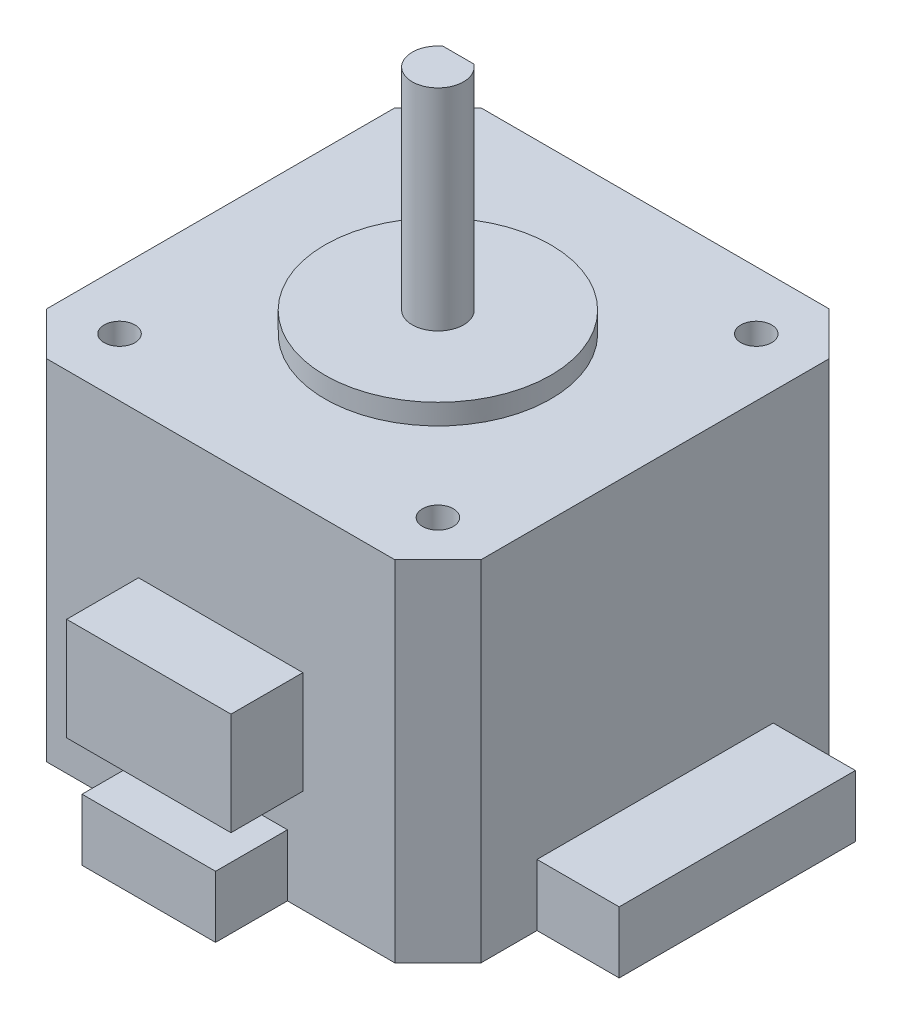
ISO-10303-21;
HEADER;
FILE_DESCRIPTION(('STEP AP214'),'2;1');
FILE_NAME('part.step','',(''),(''),'','','');
FILE_SCHEMA(('AUTOMOTIVE_DESIGN { 1 0 10303 214 1 1 1 1 }'));
ENDSEC;
DATA;
#1=APPLICATION_CONTEXT('core data for automotive mechanical design processes');
#2=APPLICATION_PROTOCOL_DEFINITION('international standard','automotive_design',2000,#1);
#3=PRODUCT_CONTEXT('',#1,'mechanical');
#4=PRODUCT('Part','Part','',(#3));
#5=PRODUCT_RELATED_PRODUCT_CATEGORY('part','',(#4));
#6=PRODUCT_DEFINITION_FORMATION('','',#4);
#7=PRODUCT_DEFINITION_CONTEXT('part definition',#1,'design');
#8=PRODUCT_DEFINITION('design','',#6,#7);
#9=PRODUCT_DEFINITION_SHAPE('','',#8);
#10=(LENGTH_UNIT() NAMED_UNIT(*) SI_UNIT(.MILLI.,.METRE.));
#11=(NAMED_UNIT(*) PLANE_ANGLE_UNIT() SI_UNIT($,.RADIAN.));
#12=(NAMED_UNIT(*) SI_UNIT($,.STERADIAN.) SOLID_ANGLE_UNIT());
#13=UNCERTAINTY_MEASURE_WITH_UNIT(LENGTH_MEASURE(1.E-05),#10,'distance_accuracy_value','');
#14=(GEOMETRIC_REPRESENTATION_CONTEXT(3) GLOBAL_UNCERTAINTY_ASSIGNED_CONTEXT((#13)) GLOBAL_UNIT_ASSIGNED_CONTEXT((#10,
#11,#12)) REPRESENTATION_CONTEXT('',''));
#15=CARTESIAN_POINT('',(0.,0.,0.));
#16=DIRECTION('',(0.,0.,1.));
#17=DIRECTION('',(1.,0.,0.));
#18=AXIS2_PLACEMENT_3D('',#15,#16,#17);
#19=CARTESIAN_POINT('',(42.3,34.,0.));
#20=DIRECTION('',(-1.,0.,0.));
#21=DIRECTION('',(0.,0.,1.));
#22=AXIS2_PLACEMENT_3D('',#19,#20,#21);
#23=PLANE('',#22);
#24=DIRECTION('',(0.,-1.,0.));
#25=VECTOR('',#24,1.);
#26=CARTESIAN_POINT('',(42.3,0.,-9.64999999999999));
#27=LINE('',#26,#25);
#28=CARTESIAN_POINT('',(42.3,6.,-9.64999999999999));
#29=VERTEX_POINT('',#28);
#30=CARTESIAN_POINT('',(42.3,0.,-9.64999999999999));
#31=VERTEX_POINT('',#30);
#32=EDGE_CURVE('E58',#29,#31,#27,.T.);
#33=ORIENTED_EDGE('',*,*,#32,.F.);
#34=DIRECTION('',(0.,0.,1.));
#35=VECTOR('',#34,1.);
#36=CARTESIAN_POINT('',(42.3,6.,-9.64999999999999));
#37=LINE('',#36,#35);
#38=CARTESIAN_POINT('',(42.3,6.,-32.65));
#39=VERTEX_POINT('',#38);
#40=EDGE_CURVE('E212',#39,#29,#37,.T.);
#41=ORIENTED_EDGE('',*,*,#40,.F.);
#42=DIRECTION('',(0.,1.,0.));
#43=VECTOR('',#42,1.);
#44=CARTESIAN_POINT('',(42.3,0.,-32.65));
#45=LINE('',#44,#43);
#46=CARTESIAN_POINT('',(42.3,0.,-32.65));
#47=VERTEX_POINT('',#46);
#48=EDGE_CURVE('E64',#47,#39,#45,.T.);
#49=ORIENTED_EDGE('',*,*,#48,.F.);
#50=DIRECTION('',(0.,0.,-1.));
#51=VECTOR('',#50,1.);
#52=CARTESIAN_POINT('',(42.3,0.,0.));
#53=LINE('',#52,#51);
#54=CARTESIAN_POINT('',(42.3,0.,-38.1));
#55=VERTEX_POINT('',#54);
#56=EDGE_CURVE('E345',#47,#55,#53,.T.);
#57=ORIENTED_EDGE('',*,*,#56,.T.);
#58=DIRECTION('',(0.,1.,0.));
#59=VECTOR('',#58,1.);
#60=CARTESIAN_POINT('',(42.3,34.,-38.1));
#61=LINE('',#60,#59);
#62=CARTESIAN_POINT('',(42.3,34.,-38.1));
#63=VERTEX_POINT('',#62);
#64=EDGE_CURVE('E380',#55,#63,#61,.T.);
#65=ORIENTED_EDGE('',*,*,#64,.T.);
#66=DIRECTION('',(0.,0.,-1.));
#67=VECTOR('',#66,1.);
#68=CARTESIAN_POINT('',(42.3,34.,0.));
#69=LINE('',#68,#67);
#70=CARTESIAN_POINT('',(42.3,34.,-4.2));
#71=VERTEX_POINT('',#70);
#72=EDGE_CURVE('E333',#71,#63,#69,.T.);
#73=ORIENTED_EDGE('',*,*,#72,.F.);
#74=DIRECTION('',(0.,-1.,0.));
#75=VECTOR('',#74,1.);
#76=CARTESIAN_POINT('',(42.3,34.,-4.2));
#77=LINE('',#76,#75);
#78=CARTESIAN_POINT('',(42.3,0.,-4.2));
#79=VERTEX_POINT('',#78);
#80=EDGE_CURVE('E377',#71,#79,#77,.T.);
#81=ORIENTED_EDGE('',*,*,#80,.T.);
#82=EDGE_CURVE('E346',#79,#31,#53,.T.);
#83=ORIENTED_EDGE('',*,*,#82,.T.);
#84=EDGE_LOOP('',(#33,#41,#49,#57,#65,#73,#81,#83));
#85=FACE_BOUND('',#84,.T.);
#86=ADVANCED_FACE('F41',(#85),#23,.F.);
#87=CARTESIAN_POINT('',(0.,34.,0.));
#88=DIRECTION('',(0.,0.,-1.));
#89=DIRECTION('',(-1.,0.,0.));
#90=AXIS2_PLACEMENT_3D('',#87,#88,#89);
#91=PLANE('',#90);
#92=DIRECTION('',(0.,-1.,0.));
#93=VECTOR('',#92,1.);
#94=CARTESIAN_POINT('',(13.15,20.,0.));
#95=LINE('',#94,#93);
#96=CARTESIAN_POINT('',(13.15,20.,0.));
#97=VERTEX_POINT('',#96);
#98=CARTESIAN_POINT('',(13.15,10.,0.));
#99=VERTEX_POINT('',#98);
#100=EDGE_CURVE('E250',#97,#99,#95,.T.);
#101=ORIENTED_EDGE('',*,*,#100,.F.);
#102=DIRECTION('',(-1.,0.,0.));
#103=VECTOR('',#102,1.);
#104=CARTESIAN_POINT('',(13.15,20.,0.));
#105=LINE('',#104,#103);
#106=CARTESIAN_POINT('',(29.15,20.,0.));
#107=VERTEX_POINT('',#106);
#108=EDGE_CURVE('E255',#107,#97,#105,.T.);
#109=ORIENTED_EDGE('',*,*,#108,.F.);
#110=DIRECTION('',(0.,1.,0.));
#111=VECTOR('',#110,1.);
#112=CARTESIAN_POINT('',(29.15,20.,0.));
#113=LINE('',#112,#111);
#114=CARTESIAN_POINT('',(29.15,10.,0.));
#115=VERTEX_POINT('',#114);
#116=EDGE_CURVE('E267',#115,#107,#113,.T.);
#117=ORIENTED_EDGE('',*,*,#116,.F.);
#118=DIRECTION('',(1.,0.,0.));
#119=VECTOR('',#118,1.);
#120=CARTESIAN_POINT('',(13.15,10.,0.));
#121=LINE('',#120,#119);
#122=EDGE_CURVE('E264',#99,#115,#121,.T.);
#123=ORIENTED_EDGE('',*,*,#122,.F.);
#124=EDGE_LOOP('',(#101,#109,#117,#123));
#125=FACE_BOUND('',#124,.T.);
#126=DIRECTION('',(0.,-1.,0.));
#127=VECTOR('',#126,1.);
#128=CARTESIAN_POINT('',(14.65,0.,0.));
#129=LINE('',#128,#127);
#130=CARTESIAN_POINT('',(14.65,6.,0.));
#131=VERTEX_POINT('',#130);
#132=CARTESIAN_POINT('',(14.65,0.,0.));
#133=VERTEX_POINT('',#132);
#134=EDGE_CURVE('E215',#131,#133,#129,.T.);
#135=ORIENTED_EDGE('',*,*,#134,.F.);
#136=DIRECTION('',(-1.,0.,0.));
#137=VECTOR('',#136,1.);
#138=CARTESIAN_POINT('',(14.65,6.,0.));
#139=LINE('',#138,#137);
#140=CARTESIAN_POINT('',(27.65,6.,0.));
#141=VERTEX_POINT('',#140);
#142=EDGE_CURVE('E228',#141,#131,#139,.T.);
#143=ORIENTED_EDGE('',*,*,#142,.F.);
#144=DIRECTION('',(0.,1.,0.));
#145=VECTOR('',#144,1.);
#146=CARTESIAN_POINT('',(27.65,0.,0.));
#147=LINE('',#146,#145);
#148=CARTESIAN_POINT('',(27.65,0.,0.));
#149=VERTEX_POINT('',#148);
#150=EDGE_CURVE('E218',#149,#141,#147,.T.);
#151=ORIENTED_EDGE('',*,*,#150,.F.);
#152=DIRECTION('',(1.,0.,0.));
#153=VECTOR('',#152,1.);
#154=CARTESIAN_POINT('',(0.,0.,0.));
#155=LINE('',#154,#153);
#156=CARTESIAN_POINT('',(38.1,0.,0.));
#157=VERTEX_POINT('',#156);
#158=EDGE_CURVE('E342',#149,#157,#155,.T.);
#159=ORIENTED_EDGE('',*,*,#158,.T.);
#160=DIRECTION('',(0.,1.,0.));
#161=VECTOR('',#160,1.);
#162=CARTESIAN_POINT('',(38.1,34.,0.));
#163=LINE('',#162,#161);
#164=CARTESIAN_POINT('',(38.1,34.,0.));
#165=VERTEX_POINT('',#164);
#166=EDGE_CURVE('E382',#157,#165,#163,.T.);
#167=ORIENTED_EDGE('',*,*,#166,.T.);
#168=DIRECTION('',(1.,0.,0.));
#169=VECTOR('',#168,1.);
#170=CARTESIAN_POINT('',(0.,34.,0.));
#171=LINE('',#170,#169);
#172=CARTESIAN_POINT('',(4.2,34.,0.));
#173=VERTEX_POINT('',#172);
#174=EDGE_CURVE('E329',#173,#165,#171,.T.);
#175=ORIENTED_EDGE('',*,*,#174,.F.);
#176=DIRECTION('',(0.,-1.,0.));
#177=VECTOR('',#176,1.);
#178=CARTESIAN_POINT('',(4.2,34.,0.));
#179=LINE('',#178,#177);
#180=CARTESIAN_POINT('',(4.2,0.,0.));
#181=VERTEX_POINT('',#180);
#182=EDGE_CURVE('E383',#173,#181,#179,.T.);
#183=ORIENTED_EDGE('',*,*,#182,.T.);
#184=EDGE_CURVE('E343',#181,#133,#155,.T.);
#185=ORIENTED_EDGE('',*,*,#184,.T.);
#186=EDGE_LOOP('',(#135,#143,#151,#159,#167,#175,#183,#185));
#187=FACE_BOUND('',#186,.T.);
#188=ADVANCED_FACE('F425',(#125,#187),#91,.F.);
#189=CARTESIAN_POINT('',(0.,34.,0.));
#190=DIRECTION('',(1.,0.,0.));
#191=DIRECTION('',(0.,0.,-1.));
#192=AXIS2_PLACEMENT_3D('',#189,#190,#191);
#193=PLANE('',#192);
#194=DIRECTION('',(0.,0.,1.));
#195=VECTOR('',#194,1.);
#196=CARTESIAN_POINT('',(0.,34.,0.));
#197=LINE('',#196,#195);
#198=CARTESIAN_POINT('',(0.,34.,-38.1));
#199=VERTEX_POINT('',#198);
#200=CARTESIAN_POINT('',(0.,34.,-4.20000000000002));
#201=VERTEX_POINT('',#200);
#202=EDGE_CURVE('E326',#199,#201,#197,.T.);
#203=ORIENTED_EDGE('',*,*,#202,.F.);
#204=DIRECTION('',(0.,-1.,0.));
#205=VECTOR('',#204,1.);
#206=CARTESIAN_POINT('',(0.,34.,-38.1));
#207=LINE('',#206,#205);
#208=CARTESIAN_POINT('',(0.,0.,-38.1));
#209=VERTEX_POINT('',#208);
#210=EDGE_CURVE('E351',#199,#209,#207,.T.);
#211=ORIENTED_EDGE('',*,*,#210,.T.);
#212=DIRECTION('',(0.,0.,1.));
#213=VECTOR('',#212,1.);
#214=CARTESIAN_POINT('',(0.,0.,0.));
#215=LINE('',#214,#213);
#216=CARTESIAN_POINT('',(0.,0.,-4.20000000000002));
#217=VERTEX_POINT('',#216);
#218=EDGE_CURVE('E323',#209,#217,#215,.T.);
#219=ORIENTED_EDGE('',*,*,#218,.T.);
#220=DIRECTION('',(0.,1.,0.));
#221=VECTOR('',#220,1.);
#222=CARTESIAN_POINT('',(0.,34.,-4.20000000000002));
#223=LINE('',#222,#221);
#224=EDGE_CURVE('E339',#217,#201,#223,.T.);
#225=ORIENTED_EDGE('',*,*,#224,.T.);
#226=EDGE_LOOP('',(#203,#211,#219,#225));
#227=FACE_BOUND('',#226,.T.);
#228=ADVANCED_FACE('F418',(#227),#193,.F.);
#229=CARTESIAN_POINT('',(0.,34.,-42.3));
#230=DIRECTION('',(0.,0.,1.));
#231=DIRECTION('',(1.,0.,0.));
#232=AXIS2_PLACEMENT_3D('',#229,#230,#231);
#233=PLANE('',#232);
#234=DIRECTION('',(-1.,0.,0.));
#235=VECTOR('',#234,1.);
#236=CARTESIAN_POINT('',(0.,0.,-42.3));
#237=LINE('',#236,#235);
#238=CARTESIAN_POINT('',(38.1,0.,-42.3));
#239=VERTEX_POINT('',#238);
#240=CARTESIAN_POINT('',(4.20000000000002,0.,-42.3));
#241=VERTEX_POINT('',#240);
#242=EDGE_CURVE('E330',#239,#241,#237,.T.);
#243=ORIENTED_EDGE('',*,*,#242,.T.);
#244=DIRECTION('',(0.,1.,0.));
#245=VECTOR('',#244,1.);
#246=CARTESIAN_POINT('',(4.20000000000002,34.,-42.3));
#247=LINE('',#246,#245);
#248=CARTESIAN_POINT('',(4.20000000000002,34.,-42.3));
#249=VERTEX_POINT('',#248);
#250=EDGE_CURVE('E367',#241,#249,#247,.T.);
#251=ORIENTED_EDGE('',*,*,#250,.T.);
#252=DIRECTION('',(-1.,0.,0.));
#253=VECTOR('',#252,1.);
#254=CARTESIAN_POINT('',(0.,34.,-42.3));
#255=LINE('',#254,#253);
#256=CARTESIAN_POINT('',(38.1,34.,-42.3));
#257=VERTEX_POINT('',#256);
#258=EDGE_CURVE('E336',#257,#249,#255,.T.);
#259=ORIENTED_EDGE('',*,*,#258,.F.);
#260=DIRECTION('',(0.,-1.,0.));
#261=VECTOR('',#260,1.);
#262=CARTESIAN_POINT('',(38.1,34.,-42.3));
#263=LINE('',#262,#261);
#264=EDGE_CURVE('E364',#257,#239,#263,.T.);
#265=ORIENTED_EDGE('',*,*,#264,.T.);
#266=EDGE_LOOP('',(#243,#251,#259,#265));
#267=FACE_BOUND('',#266,.T.);
#268=ADVANCED_FACE('F397',(#267),#233,.F.);
#269=CARTESIAN_POINT('',(0.,34.,0.));
#270=DIRECTION('',(0.,-1.,0.));
#271=DIRECTION('',(0.,0.,-1.));
#272=AXIS2_PLACEMENT_3D('',#269,#270,#271);
#273=PLANE('',#272);
#274=CARTESIAN_POINT('',(21.15,34.,-21.15));
#275=DIRECTION('',(0.,-1.,0.));
#276=DIRECTION('',(0.,0.,-1.));
#277=AXIS2_PLACEMENT_3D('',#274,#275,#276);
#278=CIRCLE('',#277,11.);
#279=CARTESIAN_POINT('',(21.15,34.,-32.15));
#280=VERTEX_POINT('',#279);
#281=EDGE_CURVE('E46',#280,#280,#278,.F.);
#282=ORIENTED_EDGE('',*,*,#281,.F.);
#283=EDGE_LOOP('',(#282));
#284=FACE_BOUND('',#283,.T.);
#285=CARTESIAN_POINT('',(36.65,34.,-36.65));
#286=DIRECTION('',(0.,1.,0.));
#287=DIRECTION('',(0.,0.,1.));
#288=AXIS2_PLACEMENT_3D('',#285,#286,#287);
#289=CIRCLE('',#288,1.5);
#290=CARTESIAN_POINT('',(36.65,34.,-35.15));
#291=VERTEX_POINT('',#290);
#292=EDGE_CURVE('E312',#291,#291,#289,.T.);
#293=ORIENTED_EDGE('',*,*,#292,.F.);
#294=EDGE_LOOP('',(#293));
#295=FACE_BOUND('',#294,.T.);
#296=CARTESIAN_POINT('',(5.65,34.,-5.64999999999999));
#297=DIRECTION('',(0.,1.,0.));
#298=DIRECTION('',(0.,0.,1.));
#299=AXIS2_PLACEMENT_3D('',#296,#297,#298);
#300=CIRCLE('',#299,1.5);
#301=CARTESIAN_POINT('',(5.65,34.,-4.15));
#302=VERTEX_POINT('',#301);
#303=EDGE_CURVE('E305',#302,#302,#300,.T.);
#304=ORIENTED_EDGE('',*,*,#303,.F.);
#305=EDGE_LOOP('',(#304));
#306=FACE_BOUND('',#305,.T.);
#307=CARTESIAN_POINT('',(36.65,34.,-5.65));
#308=DIRECTION('',(0.,1.,0.));
#309=DIRECTION('',(0.,0.,1.));
#310=AXIS2_PLACEMENT_3D('',#307,#308,#309);
#311=CIRCLE('',#310,1.5);
#312=CARTESIAN_POINT('',(36.65,34.,-4.14999999999999));
#313=VERTEX_POINT('',#312);
#314=EDGE_CURVE('E301',#313,#313,#311,.T.);
#315=ORIENTED_EDGE('',*,*,#314,.F.);
#316=EDGE_LOOP('',(#315));
#317=FACE_BOUND('',#316,.T.);
#318=CARTESIAN_POINT('',(5.65,34.,-36.65));
#319=DIRECTION('',(0.,1.,0.));
#320=DIRECTION('',(0.,0.,1.));
#321=AXIS2_PLACEMENT_3D('',#318,#319,#320);
#322=CIRCLE('',#321,1.5);
#323=CARTESIAN_POINT('',(5.65,34.,-35.15));
#324=VERTEX_POINT('',#323);
#325=EDGE_CURVE('E311',#324,#324,#322,.T.);
#326=ORIENTED_EDGE('',*,*,#325,.F.);
#327=EDGE_LOOP('',(#326));
#328=FACE_BOUND('',#327,.T.);
#329=ORIENTED_EDGE('',*,*,#258,.T.);
#330=DIRECTION('',(0.707106781186548,0.,-0.707106781186547));
#331=VECTOR('',#330,1.);
#332=CARTESIAN_POINT('',(0.,34.,-38.1));
#333=LINE('',#332,#331);
#334=EDGE_CURVE('E375',#249,#199,#333,.F.);
#335=ORIENTED_EDGE('',*,*,#334,.T.);
#336=ORIENTED_EDGE('',*,*,#202,.T.);
#337=DIRECTION('',(-0.707106781186546,0.,-0.707106781186549));
#338=VECTOR('',#337,1.);
#339=CARTESIAN_POINT('',(4.2,34.,0.));
#340=LINE('',#339,#338);
#341=EDGE_CURVE('E371',#201,#173,#340,.F.);
#342=ORIENTED_EDGE('',*,*,#341,.T.);
#343=ORIENTED_EDGE('',*,*,#174,.T.);
#344=DIRECTION('',(-0.707106781186549,0.,0.707106781186546));
#345=VECTOR('',#344,1.);
#346=CARTESIAN_POINT('',(42.3,34.,-4.2));
#347=LINE('',#346,#345);
#348=EDGE_CURVE('E369',#165,#71,#347,.F.);
#349=ORIENTED_EDGE('',*,*,#348,.T.);
#350=ORIENTED_EDGE('',*,*,#72,.T.);
#351=DIRECTION('',(0.707106781186547,0.,0.707106781186548));
#352=VECTOR('',#351,1.);
#353=CARTESIAN_POINT('',(38.1,34.,-42.3));
#354=LINE('',#353,#352);
#355=EDGE_CURVE('E373',#63,#257,#354,.F.);
#356=ORIENTED_EDGE('',*,*,#355,.T.);
#357=EDGE_LOOP('',(#329,#335,#336,#342,#343,#349,#350,#356));
#358=FACE_BOUND('',#357,.T.);
#359=ADVANCED_FACE('F394',(#284,#295,#306,#317,#328,#358),#273,.F.);
#360=CARTESIAN_POINT('',(0.,0.,0.));
#361=DIRECTION('',(0.,-1.,0.));
#362=DIRECTION('',(0.,0.,-1.));
#363=AXIS2_PLACEMENT_3D('',#360,#361,#362);
#364=PLANE('',#363);
#365=ORIENTED_EDGE('',*,*,#218,.F.);
#366=DIRECTION('',(-0.707106781186548,0.,0.707106781186547));
#367=VECTOR('',#366,1.);
#368=CARTESIAN_POINT('',(-19.05,0.,-19.05));
#369=LINE('',#368,#367);
#370=EDGE_CURVE('E362',#209,#241,#369,.F.);
#371=ORIENTED_EDGE('',*,*,#370,.T.);
#372=ORIENTED_EDGE('',*,*,#242,.F.);
#373=DIRECTION('',(-0.707106781186547,0.,-0.707106781186548));
#374=VECTOR('',#373,1.);
#375=CARTESIAN_POINT('',(40.2,0.,-40.2));
#376=LINE('',#375,#374);
#377=EDGE_CURVE('E359',#239,#55,#376,.F.);
#378=ORIENTED_EDGE('',*,*,#377,.T.);
#379=ORIENTED_EDGE('',*,*,#56,.F.);
#380=DIRECTION('',(-1.,0.,0.));
#381=VECTOR('',#380,1.);
#382=CARTESIAN_POINT('',(50.3,0.,-32.65));
#383=LINE('',#382,#381);
#384=CARTESIAN_POINT('',(50.3,0.,-32.65));
#385=VERTEX_POINT('',#384);
#386=EDGE_CURVE('E199',#385,#47,#383,.T.);
#387=ORIENTED_EDGE('',*,*,#386,.F.);
#388=DIRECTION('',(0.,0.,-1.));
#389=VECTOR('',#388,1.);
#390=CARTESIAN_POINT('',(50.3,0.,-9.64999999999999));
#391=LINE('',#390,#389);
#392=CARTESIAN_POINT('',(50.3,0.,-9.64999999999999));
#393=VERTEX_POINT('',#392);
#394=EDGE_CURVE('E191',#393,#385,#391,.T.);
#395=ORIENTED_EDGE('',*,*,#394,.F.);
#396=DIRECTION('',(-1.,0.,0.));
#397=VECTOR('',#396,1.);
#398=CARTESIAN_POINT('',(50.3,0.,-9.64999999999999));
#399=LINE('',#398,#397);
#400=EDGE_CURVE('E197',#393,#31,#399,.T.);
#401=ORIENTED_EDGE('',*,*,#400,.T.);
#402=ORIENTED_EDGE('',*,*,#82,.F.);
#403=DIRECTION('',(0.707106781186549,0.,-0.707106781186546));
#404=VECTOR('',#403,1.);
#405=CARTESIAN_POINT('',(19.0499999999999,0.,19.05));
#406=LINE('',#405,#404);
#407=EDGE_CURVE('E354',#79,#157,#406,.F.);
#408=ORIENTED_EDGE('',*,*,#407,.T.);
#409=ORIENTED_EDGE('',*,*,#158,.F.);
#410=DIRECTION('',(0.,0.,-1.));
#411=VECTOR('',#410,1.);
#412=CARTESIAN_POINT('',(27.65,0.,7.));
#413=LINE('',#412,#411);
#414=CARTESIAN_POINT('',(27.65,0.,7.));
#415=VERTEX_POINT('',#414);
#416=EDGE_CURVE('E244',#415,#149,#413,.T.);
#417=ORIENTED_EDGE('',*,*,#416,.F.);
#418=DIRECTION('',(1.,0.,0.));
#419=VECTOR('',#418,1.);
#420=CARTESIAN_POINT('',(14.65,0.,7.));
#421=LINE('',#420,#419);
#422=CARTESIAN_POINT('',(14.65,0.,7.));
#423=VERTEX_POINT('',#422);
#424=EDGE_CURVE('E227',#423,#415,#421,.T.);
#425=ORIENTED_EDGE('',*,*,#424,.F.);
#426=DIRECTION('',(0.,0.,-1.));
#427=VECTOR('',#426,1.);
#428=CARTESIAN_POINT('',(14.65,0.,7.));
#429=LINE('',#428,#427);
#430=EDGE_CURVE('E247',#423,#133,#429,.T.);
#431=ORIENTED_EDGE('',*,*,#430,.T.);
#432=ORIENTED_EDGE('',*,*,#184,.F.);
#433=DIRECTION('',(0.707106781186546,0.,0.707106781186549));
#434=VECTOR('',#433,1.);
#435=CARTESIAN_POINT('',(2.10000000000001,0.,-2.1));
#436=LINE('',#435,#434);
#437=EDGE_CURVE('E357',#181,#217,#436,.F.);
#438=ORIENTED_EDGE('',*,*,#437,.T.);
#439=EDGE_LOOP('',(#365,#371,#372,#378,#379,#387,#395,#401,#402,#408,#409,#417,#425,#431,#432,#438));
#440=FACE_BOUND('',#439,.T.);
#441=ADVANCED_FACE('F194',(#440),#364,.T.);
#442=CARTESIAN_POINT('',(0.,34.,-38.1));
#443=DIRECTION('',(0.707106781186547,0.,0.707106781186548));
#444=DIRECTION('',(0.,-1.,0.));
#445=AXIS2_PLACEMENT_3D('',#442,#443,#444);
#446=PLANE('',#445);
#447=ORIENTED_EDGE('',*,*,#334,.F.);
#448=ORIENTED_EDGE('',*,*,#250,.F.);
#449=ORIENTED_EDGE('',*,*,#370,.F.);
#450=ORIENTED_EDGE('',*,*,#210,.F.);
#451=EDGE_LOOP('',(#447,#448,#449,#450));
#452=FACE_BOUND('',#451,.T.);
#453=ADVANCED_FACE('F416',(#452),#446,.F.);
#454=CARTESIAN_POINT('',(38.1,34.,-42.3));
#455=DIRECTION('',(-0.707106781186548,0.,0.707106781186547));
#456=DIRECTION('',(0.,-1.,0.));
#457=AXIS2_PLACEMENT_3D('',#454,#455,#456);
#458=PLANE('',#457);
#459=ORIENTED_EDGE('',*,*,#355,.F.);
#460=ORIENTED_EDGE('',*,*,#64,.F.);
#461=ORIENTED_EDGE('',*,*,#377,.F.);
#462=ORIENTED_EDGE('',*,*,#264,.F.);
#463=EDGE_LOOP('',(#459,#460,#461,#462));
#464=FACE_BOUND('',#463,.T.);
#465=ADVANCED_FACE('F433',(#464),#458,.F.);
#466=CARTESIAN_POINT('',(4.2,34.,0.));
#467=DIRECTION('',(0.707106781186549,0.,-0.707106781186546));
#468=DIRECTION('',(0.,-1.,0.));
#469=AXIS2_PLACEMENT_3D('',#466,#467,#468);
#470=PLANE('',#469);
#471=ORIENTED_EDGE('',*,*,#341,.F.);
#472=ORIENTED_EDGE('',*,*,#224,.F.);
#473=ORIENTED_EDGE('',*,*,#437,.F.);
#474=ORIENTED_EDGE('',*,*,#182,.F.);
#475=EDGE_LOOP('',(#471,#472,#473,#474));
#476=FACE_BOUND('',#475,.T.);
#477=ADVANCED_FACE('F423',(#476),#470,.F.);
#478=CARTESIAN_POINT('',(42.3,34.,-4.2));
#479=DIRECTION('',(-0.707106781186546,0.,-0.707106781186549));
#480=DIRECTION('',(0.,-1.,0.));
#481=AXIS2_PLACEMENT_3D('',#478,#479,#480);
#482=PLANE('',#481);
#483=ORIENTED_EDGE('',*,*,#348,.F.);
#484=ORIENTED_EDGE('',*,*,#166,.F.);
#485=ORIENTED_EDGE('',*,*,#407,.F.);
#486=ORIENTED_EDGE('',*,*,#80,.F.);
#487=EDGE_LOOP('',(#483,#484,#485,#486));
#488=FACE_BOUND('',#487,.T.);
#489=ADVANCED_FACE('F44',(#488),#482,.F.);
#490=CARTESIAN_POINT('',(5.65,29.5,-36.65));
#491=DIRECTION('',(0.,1.,0.));
#492=DIRECTION('',(0.,0.,1.));
#493=AXIS2_PLACEMENT_3D('',#490,#491,#492);
#494=CYLINDRICAL_SURFACE('',#493,1.5);
#495=CARTESIAN_POINT('',(5.65,29.5,-36.65));
#496=DIRECTION('',(0.,1.,0.));
#497=DIRECTION('',(0.,0.,1.));
#498=AXIS2_PLACEMENT_3D('',#495,#496,#497);
#499=CIRCLE('',#498,1.5);
#500=CARTESIAN_POINT('',(5.65,29.5,-35.15));
#501=VERTEX_POINT('',#500);
#502=EDGE_CURVE('E320',#501,#501,#499,.T.);
#503=ORIENTED_EDGE('',*,*,#502,.F.);
#504=EDGE_LOOP('',(#503));
#505=FACE_BOUND('',#504,.T.);
#506=ORIENTED_EDGE('',*,*,#325,.T.);
#507=EDGE_LOOP('',(#506));
#508=FACE_BOUND('',#507,.T.);
#509=ADVANCED_FACE('F483',(#505,#508),#494,.F.);
#510=CARTESIAN_POINT('',(5.65,29.5,-36.65));
#511=DIRECTION('',(0.,1.,0.));
#512=DIRECTION('',(0.,0.,1.));
#513=AXIS2_PLACEMENT_3D('',#510,#511,#512);
#514=PLANE('',#513);
#515=ORIENTED_EDGE('',*,*,#502,.T.);
#516=EDGE_LOOP('',(#515));
#517=FACE_BOUND('',#516,.T.);
#518=ADVANCED_FACE('F488',(#517),#514,.T.);
#519=CARTESIAN_POINT('',(36.65,29.5,-5.65));
#520=DIRECTION('',(0.,1.,0.));
#521=DIRECTION('',(0.,0.,1.));
#522=AXIS2_PLACEMENT_3D('',#519,#520,#521);
#523=CYLINDRICAL_SURFACE('',#522,1.5);
#524=CARTESIAN_POINT('',(36.65,29.5,-5.65));
#525=DIRECTION('',(0.,1.,0.));
#526=DIRECTION('',(0.,0.,1.));
#527=AXIS2_PLACEMENT_3D('',#524,#525,#526);
#528=CIRCLE('',#527,1.5);
#529=CARTESIAN_POINT('',(36.65,29.5,-4.14999999999999));
#530=VERTEX_POINT('',#529);
#531=EDGE_CURVE('E302',#530,#530,#528,.T.);
#532=ORIENTED_EDGE('',*,*,#531,.F.);
#533=EDGE_LOOP('',(#532));
#534=FACE_BOUND('',#533,.T.);
#535=ORIENTED_EDGE('',*,*,#314,.T.);
#536=EDGE_LOOP('',(#535));
#537=FACE_BOUND('',#536,.T.);
#538=ADVANCED_FACE('F494',(#534,#537),#523,.F.);
#539=CARTESIAN_POINT('',(36.65,29.5,-5.65));
#540=DIRECTION('',(0.,1.,0.));
#541=DIRECTION('',(0.,0.,1.));
#542=AXIS2_PLACEMENT_3D('',#539,#540,#541);
#543=PLANE('',#542);
#544=ORIENTED_EDGE('',*,*,#531,.T.);
#545=EDGE_LOOP('',(#544));
#546=FACE_BOUND('',#545,.T.);
#547=ADVANCED_FACE('F731',(#546),#543,.T.);
#548=CARTESIAN_POINT('',(5.65,29.5,-5.64999999999999));
#549=DIRECTION('',(0.,1.,0.));
#550=DIRECTION('',(0.,0.,1.));
#551=AXIS2_PLACEMENT_3D('',#548,#549,#550);
#552=CYLINDRICAL_SURFACE('',#551,1.5);
#553=CARTESIAN_POINT('',(5.65,29.5,-5.64999999999999));
#554=DIRECTION('',(0.,1.,0.));
#555=DIRECTION('',(0.,0.,1.));
#556=AXIS2_PLACEMENT_3D('',#553,#554,#555);
#557=CIRCLE('',#556,1.5);
#558=CARTESIAN_POINT('',(5.65,29.5,-4.15));
#559=VERTEX_POINT('',#558);
#560=EDGE_CURVE('E315',#559,#559,#557,.T.);
#561=ORIENTED_EDGE('',*,*,#560,.F.);
#562=EDGE_LOOP('',(#561));
#563=FACE_BOUND('',#562,.T.);
#564=ORIENTED_EDGE('',*,*,#303,.T.);
#565=EDGE_LOOP('',(#564));
#566=FACE_BOUND('',#565,.T.);
#567=ADVANCED_FACE('F722',(#563,#566),#552,.F.);
#568=CARTESIAN_POINT('',(5.65,29.5,-5.64999999999999));
#569=DIRECTION('',(0.,1.,0.));
#570=DIRECTION('',(0.,0.,1.));
#571=AXIS2_PLACEMENT_3D('',#568,#569,#570);
#572=PLANE('',#571);
#573=ORIENTED_EDGE('',*,*,#560,.T.);
#574=EDGE_LOOP('',(#573));
#575=FACE_BOUND('',#574,.T.);
#576=ADVANCED_FACE('F713',(#575),#572,.T.);
#577=CARTESIAN_POINT('',(36.65,29.5,-36.65));
#578=DIRECTION('',(0.,1.,0.));
#579=DIRECTION('',(0.,0.,1.));
#580=AXIS2_PLACEMENT_3D('',#577,#578,#579);
#581=CYLINDRICAL_SURFACE('',#580,1.5);
#582=CARTESIAN_POINT('',(36.65,29.5,-36.65));
#583=DIRECTION('',(0.,1.,0.));
#584=DIRECTION('',(0.,0.,1.));
#585=AXIS2_PLACEMENT_3D('',#582,#583,#584);
#586=CIRCLE('',#585,1.5);
#587=CARTESIAN_POINT('',(36.65,29.5,-35.15));
#588=VERTEX_POINT('',#587);
#589=EDGE_CURVE('E308',#588,#588,#586,.T.);
#590=ORIENTED_EDGE('',*,*,#589,.F.);
#591=EDGE_LOOP('',(#590));
#592=FACE_BOUND('',#591,.T.);
#593=ORIENTED_EDGE('',*,*,#292,.T.);
#594=EDGE_LOOP('',(#593));
#595=FACE_BOUND('',#594,.T.);
#596=ADVANCED_FACE('F704',(#592,#595),#581,.F.);
#597=CARTESIAN_POINT('',(36.65,29.5,-36.65));
#598=DIRECTION('',(0.,1.,0.));
#599=DIRECTION('',(0.,0.,1.));
#600=AXIS2_PLACEMENT_3D('',#597,#598,#599);
#601=PLANE('',#600);
#602=ORIENTED_EDGE('',*,*,#589,.T.);
#603=EDGE_LOOP('',(#602));
#604=FACE_BOUND('',#603,.T.);
#605=ADVANCED_FACE('F694',(#604),#601,.T.);
#606=CARTESIAN_POINT('',(21.15,36.,-21.15));
#607=DIRECTION('',(0.,-1.,0.));
#608=DIRECTION('',(0.,0.,-1.));
#609=AXIS2_PLACEMENT_3D('',#606,#607,#608);
#610=CYLINDRICAL_SURFACE('',#609,11.);
#611=CARTESIAN_POINT('',(21.15,36.,-21.15));
#612=DIRECTION('',(0.,1.,0.));
#613=DIRECTION('',(0.,0.,1.));
#614=AXIS2_PLACEMENT_3D('',#611,#612,#613);
#615=CIRCLE('',#614,11.);
#616=CARTESIAN_POINT('',(21.15,36.,-10.15));
#617=VERTEX_POINT('',#616);
#618=EDGE_CURVE('E297',#617,#617,#615,.T.);
#619=ORIENTED_EDGE('',*,*,#618,.F.);
#620=EDGE_LOOP('',(#619));
#621=FACE_BOUND('',#620,.T.);
#622=ORIENTED_EDGE('',*,*,#281,.T.);
#623=EDGE_LOOP('',(#622));
#624=FACE_BOUND('',#623,.T.);
#625=ADVANCED_FACE('F392',(#621,#624),#610,.T.);
#626=CARTESIAN_POINT('',(21.15,36.,-21.15));
#627=DIRECTION('',(0.,1.,0.));
#628=DIRECTION('',(0.,0.,1.));
#629=AXIS2_PLACEMENT_3D('',#626,#627,#628);
#630=PLANE('',#629);
#631=CARTESIAN_POINT('',(21.15,36.,-21.15));
#632=DIRECTION('',(0.,1.,0.));
#633=DIRECTION('',(0.,0.,1.));
#634=AXIS2_PLACEMENT_3D('',#631,#632,#633);
#635=CIRCLE('',#634,2.5);
#636=CARTESIAN_POINT('',(21.15,36.,-18.65));
#637=VERTEX_POINT('',#636);
#638=EDGE_CURVE('E11',#637,#637,#635,.T.);
#639=ORIENTED_EDGE('',*,*,#638,.F.);
#640=EDGE_LOOP('',(#639));
#641=FACE_BOUND('',#640,.T.);
#642=ORIENTED_EDGE('',*,*,#618,.T.);
#643=EDGE_LOOP('',(#642));
#644=FACE_BOUND('',#643,.T.);
#645=ADVANCED_FACE('F677',(#641,#644),#630,.T.);
#646=CARTESIAN_POINT('',(21.15,56.5,-21.15));
#647=DIRECTION('',(0.,-1.,0.));
#648=DIRECTION('',(0.,0.,-1.));
#649=AXIS2_PLACEMENT_3D('',#646,#647,#648);
#650=CYLINDRICAL_SURFACE('',#649,2.5);
#651=CARTESIAN_POINT('',(21.15,56.5,-21.15));
#652=DIRECTION('',(0.,1.,0.));
#653=DIRECTION('',(0.,0.,1.));
#654=AXIS2_PLACEMENT_3D('',#651,#652,#653);
#655=CIRCLE('',#654,2.5);
#656=CARTESIAN_POINT('',(19.65,56.5,-23.15));
#657=VERTEX_POINT('',#656);
#658=CARTESIAN_POINT('',(22.65,56.5,-23.15));
#659=VERTEX_POINT('',#658);
#660=EDGE_CURVE('E294',#657,#659,#655,.T.);
#661=ORIENTED_EDGE('',*,*,#660,.F.);
#662=DIRECTION('',(0.,1.,0.));
#663=VECTOR('',#662,1.);
#664=CARTESIAN_POINT('',(19.65,38.5,-23.15));
#665=LINE('',#664,#663);
#666=CARTESIAN_POINT('',(19.65,38.5,-23.15));
#667=VERTEX_POINT('',#666);
#668=EDGE_CURVE('E289',#667,#657,#665,.T.);
#669=ORIENTED_EDGE('',*,*,#668,.F.);
#670=CARTESIAN_POINT('',(21.15,38.5,-21.15));
#671=DIRECTION('',(0.,1.,0.));
#672=DIRECTION('',(0.,0.,1.));
#673=AXIS2_PLACEMENT_3D('',#670,#671,#672);
#674=CIRCLE('',#673,2.5);
#675=CARTESIAN_POINT('',(22.65,38.5,-23.15));
#676=VERTEX_POINT('',#675);
#677=EDGE_CURVE('E284',#676,#667,#674,.T.);
#678=ORIENTED_EDGE('',*,*,#677,.F.);
#679=DIRECTION('',(0.,1.,0.));
#680=VECTOR('',#679,1.);
#681=CARTESIAN_POINT('',(22.65,38.5,-23.15));
#682=LINE('',#681,#680);
#683=EDGE_CURVE('E291',#676,#659,#682,.T.);
#684=ORIENTED_EDGE('',*,*,#683,.T.);
#685=EDGE_LOOP('',(#661,#669,#678,#684));
#686=FACE_BOUND('',#685,.T.);
#687=ORIENTED_EDGE('',*,*,#638,.T.);
#688=EDGE_LOOP('',(#687));
#689=FACE_BOUND('',#688,.T.);
#690=ADVANCED_FACE('F668',(#686,#689),#650,.T.);
#691=CARTESIAN_POINT('',(21.15,56.5,-21.15));
#692=DIRECTION('',(0.,1.,0.));
#693=DIRECTION('',(0.,0.,1.));
#694=AXIS2_PLACEMENT_3D('',#691,#692,#693);
#695=PLANE('',#694);
#696=DIRECTION('',(1.,0.,0.));
#697=VECTOR('',#696,1.);
#698=CARTESIAN_POINT('',(19.65,56.5,-23.15));
#699=LINE('',#698,#697);
#700=EDGE_CURVE('E283',#657,#659,#699,.T.);
#701=ORIENTED_EDGE('',*,*,#700,.F.);
#702=ORIENTED_EDGE('',*,*,#660,.T.);
#703=EDGE_LOOP('',(#701,#702));
#704=FACE_BOUND('',#703,.T.);
#705=ADVANCED_FACE('F659',(#704),#695,.T.);
#706=CARTESIAN_POINT('',(19.65,38.5,-23.15));
#707=DIRECTION('',(0.,0.,1.));
#708=DIRECTION('',(1.,0.,0.));
#709=AXIS2_PLACEMENT_3D('',#706,#707,#708);
#710=PLANE('',#709);
#711=ORIENTED_EDGE('',*,*,#700,.T.);
#712=ORIENTED_EDGE('',*,*,#683,.F.);
#713=DIRECTION('',(1.,0.,0.));
#714=VECTOR('',#713,1.);
#715=CARTESIAN_POINT('',(19.65,38.5,-23.15));
#716=LINE('',#715,#714);
#717=EDGE_CURVE('E286',#667,#676,#716,.T.);
#718=ORIENTED_EDGE('',*,*,#717,.F.);
#719=ORIENTED_EDGE('',*,*,#668,.T.);
#720=EDGE_LOOP('',(#711,#712,#718,#719));
#721=FACE_BOUND('',#720,.T.);
#722=ADVANCED_FACE('F650',(#721),#710,.F.);
#723=CARTESIAN_POINT('',(21.15,38.5,-21.15));
#724=DIRECTION('',(0.,1.,0.));
#725=DIRECTION('',(0.,0.,1.));
#726=AXIS2_PLACEMENT_3D('',#723,#724,#725);
#727=PLANE('',#726);
#728=ORIENTED_EDGE('',*,*,#677,.T.);
#729=ORIENTED_EDGE('',*,*,#717,.T.);
#730=EDGE_LOOP('',(#728,#729));
#731=FACE_BOUND('',#730,.T.);
#732=ADVANCED_FACE('F515',(#731),#727,.T.);
#733=CARTESIAN_POINT('',(13.15,20.,7.));
#734=DIRECTION('',(1.,0.,0.));
#735=DIRECTION('',(0.,0.,-1.));
#736=AXIS2_PLACEMENT_3D('',#733,#734,#735);
#737=PLANE('',#736);
#738=ORIENTED_EDGE('',*,*,#100,.T.);
#739=DIRECTION('',(0.,0.,-1.));
#740=VECTOR('',#739,1.);
#741=CARTESIAN_POINT('',(13.15,10.,7.));
#742=LINE('',#741,#740);
#743=CARTESIAN_POINT('',(13.15,10.,7.));
#744=VERTEX_POINT('',#743);
#745=EDGE_CURVE('E280',#744,#99,#742,.T.);
#746=ORIENTED_EDGE('',*,*,#745,.F.);
#747=DIRECTION('',(0.,-1.,0.));
#748=VECTOR('',#747,1.);
#749=CARTESIAN_POINT('',(13.15,20.,7.));
#750=LINE('',#749,#748);
#751=CARTESIAN_POINT('',(13.15,20.,7.));
#752=VERTEX_POINT('',#751);
#753=EDGE_CURVE('E251',#752,#744,#750,.T.);
#754=ORIENTED_EDGE('',*,*,#753,.F.);
#755=DIRECTION('',(0.,0.,-1.));
#756=VECTOR('',#755,1.);
#757=CARTESIAN_POINT('',(13.15,20.,7.));
#758=LINE('',#757,#756);
#759=EDGE_CURVE('E261',#752,#97,#758,.T.);
#760=ORIENTED_EDGE('',*,*,#759,.T.);
#761=EDGE_LOOP('',(#738,#746,#754,#760));
#762=FACE_BOUND('',#761,.T.);
#763=ADVANCED_FACE('F510',(#762),#737,.F.);
#764=CARTESIAN_POINT('',(13.15,10.,7.));
#765=DIRECTION('',(0.,1.,0.));
#766=DIRECTION('',(-1.,0.,0.));
#767=AXIS2_PLACEMENT_3D('',#764,#765,#766);
#768=PLANE('',#767);
#769=ORIENTED_EDGE('',*,*,#122,.T.);
#770=DIRECTION('',(0.,0.,-1.));
#771=VECTOR('',#770,1.);
#772=CARTESIAN_POINT('',(29.15,10.,7.));
#773=LINE('',#772,#771);
#774=CARTESIAN_POINT('',(29.15,10.,7.));
#775=VERTEX_POINT('',#774);
#776=EDGE_CURVE('E277',#775,#115,#773,.T.);
#777=ORIENTED_EDGE('',*,*,#776,.F.);
#778=DIRECTION('',(1.,0.,0.));
#779=VECTOR('',#778,1.);
#780=CARTESIAN_POINT('',(13.15,10.,7.));
#781=LINE('',#780,#779);
#782=EDGE_CURVE('E254',#744,#775,#781,.T.);
#783=ORIENTED_EDGE('',*,*,#782,.F.);
#784=ORIENTED_EDGE('',*,*,#745,.T.);
#785=EDGE_LOOP('',(#769,#777,#783,#784));
#786=FACE_BOUND('',#785,.T.);
#787=ADVANCED_FACE('F514',(#786),#768,.F.);
#788=CARTESIAN_POINT('',(29.15,20.,7.));
#789=DIRECTION('',(-1.,0.,0.));
#790=DIRECTION('',(0.,-1.,0.));
#791=AXIS2_PLACEMENT_3D('',#788,#789,#790);
#792=PLANE('',#791);
#793=ORIENTED_EDGE('',*,*,#116,.T.);
#794=DIRECTION('',(0.,0.,-1.));
#795=VECTOR('',#794,1.);
#796=CARTESIAN_POINT('',(29.15,20.,7.));
#797=LINE('',#796,#795);
#798=CARTESIAN_POINT('',(29.15,20.,7.));
#799=VERTEX_POINT('',#798);
#800=EDGE_CURVE('E274',#799,#107,#797,.T.);
#801=ORIENTED_EDGE('',*,*,#800,.F.);
#802=DIRECTION('',(0.,1.,0.));
#803=VECTOR('',#802,1.);
#804=CARTESIAN_POINT('',(29.15,20.,7.));
#805=LINE('',#804,#803);
#806=EDGE_CURVE('E257',#775,#799,#805,.T.);
#807=ORIENTED_EDGE('',*,*,#806,.F.);
#808=ORIENTED_EDGE('',*,*,#776,.T.);
#809=EDGE_LOOP('',(#793,#801,#807,#808));
#810=FACE_BOUND('',#809,.T.);
#811=ADVANCED_FACE('F524',(#810),#792,.F.);
#812=CARTESIAN_POINT('',(13.15,20.,7.));
#813=DIRECTION('',(0.,-1.,0.));
#814=DIRECTION('',(1.,0.,0.));
#815=AXIS2_PLACEMENT_3D('',#812,#813,#814);
#816=PLANE('',#815);
#817=ORIENTED_EDGE('',*,*,#108,.T.);
#818=ORIENTED_EDGE('',*,*,#759,.F.);
#819=DIRECTION('',(-1.,0.,0.));
#820=VECTOR('',#819,1.);
#821=CARTESIAN_POINT('',(13.15,20.,7.));
#822=LINE('',#821,#820);
#823=EDGE_CURVE('E259',#799,#752,#822,.T.);
#824=ORIENTED_EDGE('',*,*,#823,.F.);
#825=ORIENTED_EDGE('',*,*,#800,.T.);
#826=EDGE_LOOP('',(#817,#818,#824,#825));
#827=FACE_BOUND('',#826,.T.);
#828=ADVANCED_FACE('F532',(#827),#816,.F.);
#829=CARTESIAN_POINT('',(0.,0.,7.));
#830=DIRECTION('',(0.,0.,1.));
#831=DIRECTION('',(1.,0.,0.));
#832=AXIS2_PLACEMENT_3D('',#829,#830,#831);
#833=PLANE('',#832);
#834=ORIENTED_EDGE('',*,*,#753,.T.);
#835=ORIENTED_EDGE('',*,*,#782,.T.);
#836=ORIENTED_EDGE('',*,*,#806,.T.);
#837=ORIENTED_EDGE('',*,*,#823,.T.);
#838=EDGE_LOOP('',(#834,#835,#836,#837));
#839=FACE_BOUND('',#838,.T.);
#840=ADVANCED_FACE('F540',(#839),#833,.T.);
#841=CARTESIAN_POINT('',(14.65,0.,7.));
#842=DIRECTION('',(1.,0.,0.));
#843=DIRECTION('',(0.,0.,-1.));
#844=AXIS2_PLACEMENT_3D('',#841,#842,#843);
#845=PLANE('',#844);
#846=ORIENTED_EDGE('',*,*,#134,.T.);
#847=ORIENTED_EDGE('',*,*,#430,.F.);
#848=DIRECTION('',(0.,-1.,0.));
#849=VECTOR('',#848,1.);
#850=CARTESIAN_POINT('',(14.65,0.,7.));
#851=LINE('',#850,#849);
#852=CARTESIAN_POINT('',(14.65,6.,7.));
#853=VERTEX_POINT('',#852);
#854=EDGE_CURVE('E224',#853,#423,#851,.T.);
#855=ORIENTED_EDGE('',*,*,#854,.F.);
#856=DIRECTION('',(0.,0.,-1.));
#857=VECTOR('',#856,1.);
#858=CARTESIAN_POINT('',(14.65,6.,7.));
#859=LINE('',#858,#857);
#860=EDGE_CURVE('E233',#853,#131,#859,.T.);
#861=ORIENTED_EDGE('',*,*,#860,.T.);
#862=EDGE_LOOP('',(#846,#847,#855,#861));
#863=FACE_BOUND('',#862,.T.);
#864=ADVANCED_FACE('F548',(#863),#845,.F.);
#865=CARTESIAN_POINT('',(27.65,0.,7.));
#866=DIRECTION('',(-1.,0.,0.));
#867=DIRECTION('',(0.,0.,1.));
#868=AXIS2_PLACEMENT_3D('',#865,#866,#867);
#869=PLANE('',#868);
#870=ORIENTED_EDGE('',*,*,#150,.T.);
#871=DIRECTION('',(0.,0.,-1.));
#872=VECTOR('',#871,1.);
#873=CARTESIAN_POINT('',(27.65,6.,7.));
#874=LINE('',#873,#872);
#875=CARTESIAN_POINT('',(27.65,6.,7.));
#876=VERTEX_POINT('',#875);
#877=EDGE_CURVE('E241',#876,#141,#874,.T.);
#878=ORIENTED_EDGE('',*,*,#877,.F.);
#879=DIRECTION('',(0.,1.,0.));
#880=VECTOR('',#879,1.);
#881=CARTESIAN_POINT('',(27.65,0.,7.));
#882=LINE('',#881,#880);
#883=EDGE_CURVE('E230',#415,#876,#882,.T.);
#884=ORIENTED_EDGE('',*,*,#883,.F.);
#885=ORIENTED_EDGE('',*,*,#416,.T.);
#886=EDGE_LOOP('',(#870,#878,#884,#885));
#887=FACE_BOUND('',#886,.T.);
#888=ADVANCED_FACE('F556',(#887),#869,.F.);
#889=CARTESIAN_POINT('',(14.65,6.,7.));
#890=DIRECTION('',(0.,-1.,0.));
#891=DIRECTION('',(1.,0.,0.));
#892=AXIS2_PLACEMENT_3D('',#889,#890,#891);
#893=PLANE('',#892);
#894=ORIENTED_EDGE('',*,*,#142,.T.);
#895=ORIENTED_EDGE('',*,*,#860,.F.);
#896=DIRECTION('',(-1.,0.,0.));
#897=VECTOR('',#896,1.);
#898=CARTESIAN_POINT('',(14.65,6.,7.));
#899=LINE('',#898,#897);
#900=EDGE_CURVE('E232',#876,#853,#899,.T.);
#901=ORIENTED_EDGE('',*,*,#900,.F.);
#902=ORIENTED_EDGE('',*,*,#877,.T.);
#903=EDGE_LOOP('',(#894,#895,#901,#902));
#904=FACE_BOUND('',#903,.T.);
#905=ADVANCED_FACE('F564',(#904),#893,.F.);
#906=CARTESIAN_POINT('',(0.,0.,7.));
#907=DIRECTION('',(0.,0.,-1.));
#908=DIRECTION('',(-1.,0.,0.));
#909=AXIS2_PLACEMENT_3D('',#906,#907,#908);
#910=PLANE('',#909);
#911=ORIENTED_EDGE('',*,*,#854,.T.);
#912=ORIENTED_EDGE('',*,*,#424,.T.);
#913=ORIENTED_EDGE('',*,*,#883,.T.);
#914=ORIENTED_EDGE('',*,*,#900,.T.);
#915=EDGE_LOOP('',(#911,#912,#913,#914));
#916=FACE_BOUND('',#915,.T.);
#917=ADVANCED_FACE('F572',(#916),#910,.F.);
#918=CARTESIAN_POINT('',(50.3,0.,-9.64999999999999));
#919=DIRECTION('',(0.,0.,-1.));
#920=DIRECTION('',(-1.,0.,0.));
#921=AXIS2_PLACEMENT_3D('',#918,#919,#920);
#922=PLANE('',#921);
#923=ORIENTED_EDGE('',*,*,#32,.T.);
#924=ORIENTED_EDGE('',*,*,#400,.F.);
#925=DIRECTION('',(0.,-1.,0.));
#926=VECTOR('',#925,1.);
#927=CARTESIAN_POINT('',(50.3,0.,-9.64999999999999));
#928=LINE('',#927,#926);
#929=CARTESIAN_POINT('',(50.3,6.,-9.64999999999999));
#930=VERTEX_POINT('',#929);
#931=EDGE_CURVE('E203',#930,#393,#928,.T.);
#932=ORIENTED_EDGE('',*,*,#931,.F.);
#933=DIRECTION('',(-1.,0.,0.));
#934=VECTOR('',#933,1.);
#935=CARTESIAN_POINT('',(50.3,6.,-9.64999999999999));
#936=LINE('',#935,#934);
#937=EDGE_CURVE('E439',#930,#29,#936,.T.);
#938=ORIENTED_EDGE('',*,*,#937,.T.);
#939=EDGE_LOOP('',(#923,#924,#932,#938));
#940=FACE_BOUND('',#939,.T.);
#941=ADVANCED_FACE('F214',(#940),#922,.F.);
#942=CARTESIAN_POINT('',(50.3,0.,-32.65));
#943=DIRECTION('',(0.,0.,1.));
#944=DIRECTION('',(1.,0.,0.));
#945=AXIS2_PLACEMENT_3D('',#942,#943,#944);
#946=PLANE('',#945);
#947=ORIENTED_EDGE('',*,*,#48,.T.);
#948=DIRECTION('',(-1.,0.,0.));
#949=VECTOR('',#948,1.);
#950=CARTESIAN_POINT('',(50.3,6.,-32.65));
#951=LINE('',#950,#949);
#952=CARTESIAN_POINT('',(50.3,6.,-32.65));
#953=VERTEX_POINT('',#952);
#954=EDGE_CURVE('E220',#953,#39,#951,.T.);
#955=ORIENTED_EDGE('',*,*,#954,.F.);
#956=DIRECTION('',(0.,1.,0.));
#957=VECTOR('',#956,1.);
#958=CARTESIAN_POINT('',(50.3,0.,-32.65));
#959=LINE('',#958,#957);
#960=EDGE_CURVE('E202',#385,#953,#959,.T.);
#961=ORIENTED_EDGE('',*,*,#960,.F.);
#962=ORIENTED_EDGE('',*,*,#386,.T.);
#963=EDGE_LOOP('',(#947,#955,#961,#962));
#964=FACE_BOUND('',#963,.T.);
#965=ADVANCED_FACE('F435',(#964),#946,.F.);
#966=CARTESIAN_POINT('',(50.3,6.,-9.64999999999999));
#967=DIRECTION('',(0.,-1.,0.));
#968=DIRECTION('',(0.,0.,-1.));
#969=AXIS2_PLACEMENT_3D('',#966,#967,#968);
#970=PLANE('',#969);
#971=ORIENTED_EDGE('',*,*,#40,.T.);
#972=ORIENTED_EDGE('',*,*,#937,.F.);
#973=DIRECTION('',(0.,0.,1.));
#974=VECTOR('',#973,1.);
#975=CARTESIAN_POINT('',(50.3,6.,-9.64999999999999));
#976=LINE('',#975,#974);
#977=EDGE_CURVE('E208',#953,#930,#976,.T.);
#978=ORIENTED_EDGE('',*,*,#977,.F.);
#979=ORIENTED_EDGE('',*,*,#954,.T.);
#980=EDGE_LOOP('',(#971,#972,#978,#979));
#981=FACE_BOUND('',#980,.T.);
#982=ADVANCED_FACE('F446',(#981),#970,.F.);
#983=CARTESIAN_POINT('',(50.3,0.,0.));
#984=DIRECTION('',(-1.,0.,0.));
#985=DIRECTION('',(0.,0.,1.));
#986=AXIS2_PLACEMENT_3D('',#983,#984,#985);
#987=PLANE('',#986);
#988=ORIENTED_EDGE('',*,*,#931,.T.);
#989=ORIENTED_EDGE('',*,*,#394,.T.);
#990=ORIENTED_EDGE('',*,*,#960,.T.);
#991=ORIENTED_EDGE('',*,*,#977,.T.);
#992=EDGE_LOOP('',(#988,#989,#990,#991));
#993=FACE_BOUND('',#992,.T.);
#994=ADVANCED_FACE('F206',(#993),#987,.F.);
#995=CLOSED_SHELL('',(#86,#188,#228,#268,#359,#441,#453,#465,#477,#489,#509,#518,#538,#547,#567,
#576,#596,#605,#625,#645,#690,#705,#722,#732,#763,#787,#811,#828,#840,#864,#888,#905,#917,#941,
#965,#982,#994));
#996=MANIFOLD_SOLID_BREP('B2',#995);
#997=ADVANCED_BREP_SHAPE_REPRESENTATION('',(#18,#996),#14);
#998=SHAPE_DEFINITION_REPRESENTATION(#9,#997);
ENDSEC;
END-ISO-10303-21;
